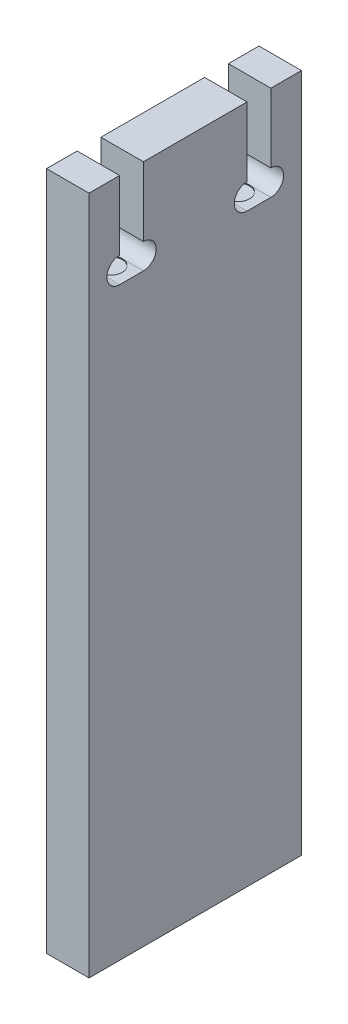
ISO-10303-21;
HEADER;
FILE_DESCRIPTION(('STEP AP214'),'2;1');
FILE_NAME('part.step','',(''),(''),'','','');
FILE_SCHEMA(('AUTOMOTIVE_DESIGN { 1 0 10303 214 1 1 1 1 }'));
ENDSEC;
DATA;
#1=APPLICATION_CONTEXT('core data for automotive mechanical design processes');
#2=APPLICATION_PROTOCOL_DEFINITION('international standard','automotive_design',2000,#1);
#3=PRODUCT_CONTEXT('',#1,'mechanical');
#4=PRODUCT('Part','Part','',(#3));
#5=PRODUCT_RELATED_PRODUCT_CATEGORY('part','',(#4));
#6=PRODUCT_DEFINITION_FORMATION('','',#4);
#7=PRODUCT_DEFINITION_CONTEXT('part definition',#1,'design');
#8=PRODUCT_DEFINITION('design','',#6,#7);
#9=PRODUCT_DEFINITION_SHAPE('','',#8);
#10=(LENGTH_UNIT() NAMED_UNIT(*) SI_UNIT(.MILLI.,.METRE.));
#11=(NAMED_UNIT(*) PLANE_ANGLE_UNIT() SI_UNIT($,.RADIAN.));
#12=(NAMED_UNIT(*) SI_UNIT($,.STERADIAN.) SOLID_ANGLE_UNIT());
#13=UNCERTAINTY_MEASURE_WITH_UNIT(LENGTH_MEASURE(1.E-05),#10,'distance_accuracy_value','');
#14=(GEOMETRIC_REPRESENTATION_CONTEXT(3) GLOBAL_UNCERTAINTY_ASSIGNED_CONTEXT((#13)) GLOBAL_UNIT_ASSIGNED_CONTEXT((#10,
#11,#12)) REPRESENTATION_CONTEXT('',''));
#15=CARTESIAN_POINT('',(0.,0.,0.));
#16=DIRECTION('',(0.,0.,1.));
#17=DIRECTION('',(1.,0.,0.));
#18=AXIS2_PLACEMENT_3D('',#15,#16,#17);
#19=CARTESIAN_POINT('',(2.5,68.8743999999999,-18.6000000000001));
#20=DIRECTION('',(0.,1.,0.));
#21=DIRECTION('',(0.,0.,1.));
#22=AXIS2_PLACEMENT_3D('',#19,#20,#21);
#23=PLANE('',#22);
#24=CARTESIAN_POINT('',(0.,68.8743999999999,-20.0000000000001));
#25=DIRECTION('',(0.,1.,0.));
#26=DIRECTION('',(0.,0.,1.));
#27=AXIS2_PLACEMENT_3D('',#24,#25,#26);
#28=CIRCLE('',#27,1.40000000000001);
#29=CARTESIAN_POINT('',(0.,68.8743999999999,-18.6000000000001));
#30=VERTEX_POINT('',#29);
#31=CARTESIAN_POINT('',(0.,68.8743999999999,-21.4000000000001));
#32=VERTEX_POINT('',#31);
#33=EDGE_CURVE('E50',#30,#32,#28,.T.);
#34=ORIENTED_EDGE('',*,*,#33,.F.);
#35=DIRECTION('',(-1.,0.,0.));
#36=VECTOR('',#35,1.);
#37=CARTESIAN_POINT('',(2.5,68.8743999999999,-18.6000000000001));
#38=LINE('',#37,#36);
#39=CARTESIAN_POINT('',(2.5,68.8743999999999,-18.6000000000001));
#40=VERTEX_POINT('',#39);
#41=EDGE_CURVE('E266',#40,#30,#38,.T.);
#42=ORIENTED_EDGE('',*,*,#41,.F.);
#43=DIRECTION('',(0.,0.,-1.));
#44=VECTOR('',#43,1.);
#45=CARTESIAN_POINT('',(2.5,68.8743999999999,-18.6000000000001));
#46=LINE('',#45,#44);
#47=CARTESIAN_POINT('',(2.5,68.8743999999999,-21.4000000000001));
#48=VERTEX_POINT('',#47);
#49=EDGE_CURVE('E311',#40,#48,#46,.T.);
#50=ORIENTED_EDGE('',*,*,#49,.T.);
#51=DIRECTION('',(-1.,0.,0.));
#52=VECTOR('',#51,1.);
#53=CARTESIAN_POINT('',(2.5,68.8743999999999,-21.4000000000001));
#54=LINE('',#53,#52);
#55=EDGE_CURVE('E262',#48,#32,#54,.T.);
#56=ORIENTED_EDGE('',*,*,#55,.T.);
#57=EDGE_LOOP('',(#34,#42,#50,#56));
#58=FACE_BOUND('',#57,.T.);
#59=ADVANCED_FACE('F34',(#58),#23,.T.);
#60=CARTESIAN_POINT('',(2.5,68.8743999999999,-6.39999999999985));
#61=DIRECTION('',(0.,-1.,0.));
#62=DIRECTION('',(0.,0.,-1.));
#63=AXIS2_PLACEMENT_3D('',#60,#61,#62);
#64=PLANE('',#63);
#65=DIRECTION('',(-1.,0.,0.));
#66=VECTOR('',#65,1.);
#67=CARTESIAN_POINT('',(2.5,68.8743999999999,-6.39999999999985));
#68=LINE('',#67,#66);
#69=CARTESIAN_POINT('',(2.5,68.8743999999999,-6.39999999999985));
#70=VERTEX_POINT('',#69);
#71=CARTESIAN_POINT('',(0.,68.8743999999999,-6.39999999999985));
#72=VERTEX_POINT('',#71);
#73=EDGE_CURVE('E171',#70,#72,#68,.T.);
#74=ORIENTED_EDGE('',*,*,#73,.T.);
#75=CARTESIAN_POINT('',(0.,68.8743999999999,-4.99999999999984));
#76=DIRECTION('',(0.,1.,0.));
#77=DIRECTION('',(0.,0.,1.));
#78=AXIS2_PLACEMENT_3D('',#75,#76,#77);
#79=CIRCLE('',#78,1.40000000000001);
#80=CARTESIAN_POINT('',(0.,68.8743999999999,-3.59999999999983));
#81=VERTEX_POINT('',#80);
#82=EDGE_CURVE('E57',#81,#72,#79,.T.);
#83=ORIENTED_EDGE('',*,*,#82,.F.);
#84=DIRECTION('',(-1.,0.,0.));
#85=VECTOR('',#84,1.);
#86=CARTESIAN_POINT('',(2.5,68.8743999999999,-3.59999999999983));
#87=LINE('',#86,#85);
#88=CARTESIAN_POINT('',(2.5,68.8743999999999,-3.59999999999983));
#89=VERTEX_POINT('',#88);
#90=EDGE_CURVE('E169',#89,#81,#87,.T.);
#91=ORIENTED_EDGE('',*,*,#90,.F.);
#92=DIRECTION('',(0.,0.,1.));
#93=VECTOR('',#92,1.);
#94=CARTESIAN_POINT('',(2.5,68.8743999999999,-6.39999999999985));
#95=LINE('',#94,#93);
#96=EDGE_CURVE('E293',#70,#89,#95,.T.);
#97=ORIENTED_EDGE('',*,*,#96,.F.);
#98=EDGE_LOOP('',(#74,#83,#91,#97));
#99=FACE_BOUND('',#98,.T.);
#100=ADVANCED_FACE('F166',(#99),#64,.F.);
#101=CARTESIAN_POINT('',(2.5,79.9999999999996,0.));
#102=DIRECTION('',(0.,1.,0.));
#103=DIRECTION('',(0.,0.,1.));
#104=AXIS2_PLACEMENT_3D('',#101,#102,#103);
#105=PLANE('',#104);
#106=DIRECTION('',(0.,0.,-1.));
#107=VECTOR('',#106,1.);
#108=CARTESIAN_POINT('',(-2.5,79.9999999999996,0.));
#109=LINE('',#108,#107);
#110=CARTESIAN_POINT('',(-2.5,79.9999999999996,0.));
#111=VERTEX_POINT('',#110);
#112=CARTESIAN_POINT('',(-2.5,79.9999999999996,-3.59999999999983));
#113=VERTEX_POINT('',#112);
#114=EDGE_CURVE('E206',#111,#113,#109,.T.);
#115=ORIENTED_EDGE('',*,*,#114,.F.);
#116=DIRECTION('',(-1.,0.,0.));
#117=VECTOR('',#116,1.);
#118=CARTESIAN_POINT('',(2.5,79.9999999999996,0.));
#119=LINE('',#118,#117);
#120=CARTESIAN_POINT('',(2.5,79.9999999999996,0.));
#121=VERTEX_POINT('',#120);
#122=EDGE_CURVE('E11',#121,#111,#119,.T.);
#123=ORIENTED_EDGE('',*,*,#122,.F.);
#124=DIRECTION('',(0.,0.,-1.));
#125=VECTOR('',#124,1.);
#126=CARTESIAN_POINT('',(2.5,79.9999999999996,0.));
#127=LINE('',#126,#125);
#128=CARTESIAN_POINT('',(2.5,79.9999999999996,-3.59999999999983));
#129=VERTEX_POINT('',#128);
#130=EDGE_CURVE('E250',#121,#129,#127,.T.);
#131=ORIENTED_EDGE('',*,*,#130,.T.);
#132=DIRECTION('',(-1.,0.,0.));
#133=VECTOR('',#132,1.);
#134=CARTESIAN_POINT('',(2.5,79.9999999999996,-3.59999999999983));
#135=LINE('',#134,#133);
#136=EDGE_CURVE('E38',#129,#113,#135,.T.);
#137=ORIENTED_EDGE('',*,*,#136,.T.);
#138=EDGE_LOOP('',(#115,#123,#131,#137));
#139=FACE_BOUND('',#138,.T.);
#140=ADVANCED_FACE('F36',(#139),#105,.T.);
#141=CARTESIAN_POINT('',(2.5,79.9999999999996,0.));
#142=DIRECTION('',(0.,0.,-1.));
#143=DIRECTION('',(-1.,0.,0.));
#144=AXIS2_PLACEMENT_3D('',#141,#142,#143);
#145=PLANE('',#144);
#146=DIRECTION('',(0.,-1.,0.));
#147=VECTOR('',#146,1.);
#148=CARTESIAN_POINT('',(-2.5,79.9999999999996,0.));
#149=LINE('',#148,#147);
#150=CARTESIAN_POINT('',(-2.5,0.,0.));
#151=VERTEX_POINT('',#150);
#152=EDGE_CURVE('E249',#111,#151,#149,.T.);
#153=ORIENTED_EDGE('',*,*,#152,.T.);
#154=DIRECTION('',(-1.,0.,0.));
#155=VECTOR('',#154,1.);
#156=CARTESIAN_POINT('',(2.5,0.,0.));
#157=LINE('',#156,#155);
#158=CARTESIAN_POINT('',(2.5,0.,0.));
#159=VERTEX_POINT('',#158);
#160=EDGE_CURVE('E43',#159,#151,#157,.T.);
#161=ORIENTED_EDGE('',*,*,#160,.F.);
#162=DIRECTION('',(0.,-1.,0.));
#163=VECTOR('',#162,1.);
#164=CARTESIAN_POINT('',(2.5,79.9999999999996,0.));
#165=LINE('',#164,#163);
#166=EDGE_CURVE('E192',#121,#159,#165,.T.);
#167=ORIENTED_EDGE('',*,*,#166,.F.);
#168=ORIENTED_EDGE('',*,*,#122,.T.);
#169=EDGE_LOOP('',(#153,#161,#167,#168));
#170=FACE_BOUND('',#169,.T.);
#171=ADVANCED_FACE('F366',(#170),#145,.F.);
#172=CARTESIAN_POINT('',(2.5,0.,0.));
#173=DIRECTION('',(0.,1.,0.));
#174=DIRECTION('',(0.,0.,1.));
#175=AXIS2_PLACEMENT_3D('',#172,#173,#174);
#176=PLANE('',#175);
#177=DIRECTION('',(0.,0.,-1.));
#178=VECTOR('',#177,1.);
#179=CARTESIAN_POINT('',(-2.5,0.,0.));
#180=LINE('',#179,#178);
#181=CARTESIAN_POINT('',(-2.5,0.,-24.9999999999999));
#182=VERTEX_POINT('',#181);
#183=EDGE_CURVE('E246',#151,#182,#180,.T.);
#184=ORIENTED_EDGE('',*,*,#183,.T.);
#185=DIRECTION('',(-1.,0.,0.));
#186=VECTOR('',#185,1.);
#187=CARTESIAN_POINT('',(2.5,0.,-24.9999999999999));
#188=LINE('',#187,#186);
#189=CARTESIAN_POINT('',(2.5,0.,-24.9999999999999));
#190=VERTEX_POINT('',#189);
#191=EDGE_CURVE('E254',#190,#182,#188,.T.);
#192=ORIENTED_EDGE('',*,*,#191,.F.);
#193=DIRECTION('',(0.,0.,-1.));
#194=VECTOR('',#193,1.);
#195=CARTESIAN_POINT('',(2.5,0.,0.));
#196=LINE('',#195,#194);
#197=EDGE_CURVE('E196',#159,#190,#196,.T.);
#198=ORIENTED_EDGE('',*,*,#197,.F.);
#199=ORIENTED_EDGE('',*,*,#160,.T.);
#200=EDGE_LOOP('',(#184,#192,#198,#199));
#201=FACE_BOUND('',#200,.T.);
#202=ADVANCED_FACE('F364',(#201),#176,.F.);
#203=CARTESIAN_POINT('',(2.5,79.9999999999996,-24.9999999999999));
#204=DIRECTION('',(0.,0.,-1.));
#205=DIRECTION('',(-1.,0.,0.));
#206=AXIS2_PLACEMENT_3D('',#203,#204,#205);
#207=PLANE('',#206);
#208=DIRECTION('',(0.,-1.,0.));
#209=VECTOR('',#208,1.);
#210=CARTESIAN_POINT('',(-2.5,79.9999999999996,-24.9999999999999));
#211=LINE('',#210,#209);
#212=CARTESIAN_POINT('',(-2.5,79.9999999999996,-24.9999999999999));
#213=VERTEX_POINT('',#212);
#214=EDGE_CURVE('E243',#213,#182,#211,.T.);
#215=ORIENTED_EDGE('',*,*,#214,.F.);
#216=DIRECTION('',(-1.,0.,0.));
#217=VECTOR('',#216,1.);
#218=CARTESIAN_POINT('',(2.5,79.9999999999996,-24.9999999999999));
#219=LINE('',#218,#217);
#220=CARTESIAN_POINT('',(2.5,79.9999999999996,-24.9999999999999));
#221=VERTEX_POINT('',#220);
#222=EDGE_CURVE('E256',#221,#213,#219,.T.);
#223=ORIENTED_EDGE('',*,*,#222,.F.);
#224=DIRECTION('',(0.,-1.,0.));
#225=VECTOR('',#224,1.);
#226=CARTESIAN_POINT('',(2.5,79.9999999999996,-24.9999999999999));
#227=LINE('',#226,#225);
#228=EDGE_CURVE('E202',#221,#190,#227,.T.);
#229=ORIENTED_EDGE('',*,*,#228,.T.);
#230=ORIENTED_EDGE('',*,*,#191,.T.);
#231=EDGE_LOOP('',(#215,#223,#229,#230));
#232=FACE_BOUND('',#231,.T.);
#233=ADVANCED_FACE('F325',(#232),#207,.T.);
#234=CARTESIAN_POINT('',(2.5,79.9999999999996,-21.4000000000001));
#235=DIRECTION('',(0.,1.,0.));
#236=DIRECTION('',(0.,0.,1.));
#237=AXIS2_PLACEMENT_3D('',#234,#235,#236);
#238=PLANE('',#237);
#239=DIRECTION('',(0.,0.,-1.));
#240=VECTOR('',#239,1.);
#241=CARTESIAN_POINT('',(-2.5,79.9999999999996,-21.4000000000001));
#242=LINE('',#241,#240);
#243=CARTESIAN_POINT('',(-2.5,79.9999999999996,-21.4000000000001));
#244=VERTEX_POINT('',#243);
#245=EDGE_CURVE('E240',#244,#213,#242,.T.);
#246=ORIENTED_EDGE('',*,*,#245,.F.);
#247=DIRECTION('',(-1.,0.,0.));
#248=VECTOR('',#247,1.);
#249=CARTESIAN_POINT('',(2.5,79.9999999999996,-21.4000000000001));
#250=LINE('',#249,#248);
#251=CARTESIAN_POINT('',(2.5,79.9999999999996,-21.4000000000001));
#252=VERTEX_POINT('',#251);
#253=EDGE_CURVE('E258',#252,#244,#250,.T.);
#254=ORIENTED_EDGE('',*,*,#253,.F.);
#255=DIRECTION('',(0.,0.,-1.));
#256=VECTOR('',#255,1.);
#257=CARTESIAN_POINT('',(2.5,79.9999999999996,-21.4000000000001));
#258=LINE('',#257,#256);
#259=EDGE_CURVE('E319',#252,#221,#258,.T.);
#260=ORIENTED_EDGE('',*,*,#259,.T.);
#261=ORIENTED_EDGE('',*,*,#222,.T.);
#262=EDGE_LOOP('',(#246,#254,#260,#261));
#263=FACE_BOUND('',#262,.T.);
#264=ADVANCED_FACE('F331',(#263),#238,.T.);
#265=CARTESIAN_POINT('',(2.5,79.9999999999996,-21.4000000000001));
#266=DIRECTION('',(0.,0.,-1.));
#267=DIRECTION('',(-1.,0.,0.));
#268=AXIS2_PLACEMENT_3D('',#265,#266,#267);
#269=PLANE('',#268);
#270=DIRECTION('',(0.,-1.,0.));
#271=VECTOR('',#270,1.);
#272=CARTESIAN_POINT('',(-2.5,79.9999999999996,-21.4000000000001));
#273=LINE('',#272,#271);
#274=CARTESIAN_POINT('',(-2.5,71.8744,-21.4000000000001));
#275=VERTEX_POINT('',#274);
#276=EDGE_CURVE('E237',#244,#275,#273,.T.);
#277=ORIENTED_EDGE('',*,*,#276,.T.);
#278=DIRECTION('',(-1.,0.,0.));
#279=VECTOR('',#278,1.);
#280=CARTESIAN_POINT('',(2.5,71.8744,-21.4000000000001));
#281=LINE('',#280,#279);
#282=CARTESIAN_POINT('',(2.5,71.8744,-21.4000000000001));
#283=VERTEX_POINT('',#282);
#284=EDGE_CURVE('E260',#283,#275,#281,.T.);
#285=ORIENTED_EDGE('',*,*,#284,.F.);
#286=DIRECTION('',(0.,-1.,0.));
#287=VECTOR('',#286,1.);
#288=CARTESIAN_POINT('',(2.5,79.9999999999996,-21.4000000000001));
#289=LINE('',#288,#287);
#290=EDGE_CURVE('E317',#252,#283,#289,.T.);
#291=ORIENTED_EDGE('',*,*,#290,.F.);
#292=ORIENTED_EDGE('',*,*,#253,.T.);
#293=EDGE_LOOP('',(#277,#285,#291,#292));
#294=FACE_BOUND('',#293,.T.);
#295=ADVANCED_FACE('F336',(#294),#269,.F.);
#296=CARTESIAN_POINT('',(2.5,70.3744,-21.4000000000001));
#297=DIRECTION('',(-1.,0.,0.));
#298=DIRECTION('',(0.,0.,1.));
#299=AXIS2_PLACEMENT_3D('',#296,#297,#298);
#300=CYLINDRICAL_SURFACE('',#299,1.50000000000006);
#301=CARTESIAN_POINT('',(-2.5,70.3744,-21.4000000000001));
#302=DIRECTION('',(1.,0.,0.));
#303=DIRECTION('',(0.,0.,-1.));
#304=AXIS2_PLACEMENT_3D('',#301,#302,#303);
#305=CIRCLE('',#304,1.50000000000006);
#306=CARTESIAN_POINT('',(-2.5,68.8743999999999,-21.4000000000001));
#307=VERTEX_POINT('',#306);
#308=EDGE_CURVE('E234',#307,#275,#305,.T.);
#309=ORIENTED_EDGE('',*,*,#308,.F.);
#310=EDGE_CURVE('E265',#32,#307,#54,.T.);
#311=ORIENTED_EDGE('',*,*,#310,.F.);
#312=ORIENTED_EDGE('',*,*,#55,.F.);
#313=CARTESIAN_POINT('',(2.5,70.3744,-21.4000000000001));
#314=DIRECTION('',(1.,0.,0.));
#315=DIRECTION('',(0.,0.,-1.));
#316=AXIS2_PLACEMENT_3D('',#313,#314,#315);
#317=CIRCLE('',#316,1.50000000000006);
#318=EDGE_CURVE('E314',#48,#283,#317,.T.);
#319=ORIENTED_EDGE('',*,*,#318,.T.);
#320=ORIENTED_EDGE('',*,*,#284,.T.);
#321=EDGE_LOOP('',(#309,#311,#312,#319,#320));
#322=FACE_BOUND('',#321,.T.);
#323=ADVANCED_FACE('F360',(#322),#300,.F.);
#324=EDGE_CURVE('E359',#32,#30,#28,.T.);
#325=ORIENTED_EDGE('',*,*,#324,.F.);
#326=ORIENTED_EDGE('',*,*,#310,.T.);
#327=DIRECTION('',(0.,0.,-1.));
#328=VECTOR('',#327,1.);
#329=CARTESIAN_POINT('',(-2.5,68.8743999999999,-18.6000000000001));
#330=LINE('',#329,#328);
#331=CARTESIAN_POINT('',(-2.5,68.8743999999999,-18.6000000000001));
#332=VERTEX_POINT('',#331);
#333=EDGE_CURVE('E231',#332,#307,#330,.T.);
#334=ORIENTED_EDGE('',*,*,#333,.F.);
#335=EDGE_CURVE('E269',#30,#332,#38,.T.);
#336=ORIENTED_EDGE('',*,*,#335,.F.);
#337=EDGE_LOOP('',(#325,#326,#334,#336));
#338=FACE_BOUND('',#337,.T.);
#339=ADVANCED_FACE('F357',(#338),#23,.T.);
#340=CARTESIAN_POINT('',(2.5,70.3744,-18.6000000000001));
#341=DIRECTION('',(-1.,0.,0.));
#342=DIRECTION('',(0.,0.,1.));
#343=AXIS2_PLACEMENT_3D('',#340,#341,#342);
#344=CYLINDRICAL_SURFACE('',#343,1.50000000000006);
#345=CARTESIAN_POINT('',(-2.5,70.3744,-18.6000000000001));
#346=DIRECTION('',(1.,0.,0.));
#347=DIRECTION('',(0.,0.,-1.));
#348=AXIS2_PLACEMENT_3D('',#345,#346,#347);
#349=CIRCLE('',#348,1.50000000000006);
#350=CARTESIAN_POINT('',(-2.5,71.8744,-18.6000000000001));
#351=VERTEX_POINT('',#350);
#352=EDGE_CURVE('E228',#351,#332,#349,.T.);
#353=ORIENTED_EDGE('',*,*,#352,.F.);
#354=DIRECTION('',(-1.,0.,0.));
#355=VECTOR('',#354,1.);
#356=CARTESIAN_POINT('',(2.5,71.8744,-18.6000000000001));
#357=LINE('',#356,#355);
#358=CARTESIAN_POINT('',(2.5,71.8744,-18.6000000000001));
#359=VERTEX_POINT('',#358);
#360=EDGE_CURVE('E270',#359,#351,#357,.T.);
#361=ORIENTED_EDGE('',*,*,#360,.F.);
#362=CARTESIAN_POINT('',(2.5,70.3744,-18.6000000000001));
#363=DIRECTION('',(1.,0.,0.));
#364=DIRECTION('',(0.,0.,-1.));
#365=AXIS2_PLACEMENT_3D('',#362,#363,#364);
#366=CIRCLE('',#365,1.50000000000006);
#367=EDGE_CURVE('E308',#359,#40,#366,.T.);
#368=ORIENTED_EDGE('',*,*,#367,.T.);
#369=ORIENTED_EDGE('',*,*,#41,.T.);
#370=ORIENTED_EDGE('',*,*,#335,.T.);
#371=EDGE_LOOP('',(#353,#361,#368,#369,#370));
#372=FACE_BOUND('',#371,.T.);
#373=ADVANCED_FACE('F345',(#372),#344,.F.);
#374=CARTESIAN_POINT('',(2.5,71.8744,-18.6000000000001));
#375=DIRECTION('',(0.,0.,1.));
#376=DIRECTION('',(1.,0.,0.));
#377=AXIS2_PLACEMENT_3D('',#374,#375,#376);
#378=PLANE('',#377);
#379=DIRECTION('',(0.,1.,0.));
#380=VECTOR('',#379,1.);
#381=CARTESIAN_POINT('',(-2.5,71.8744,-18.6000000000001));
#382=LINE('',#381,#380);
#383=CARTESIAN_POINT('',(-2.5,79.9999999999996,-18.6000000000001));
#384=VERTEX_POINT('',#383);
#385=EDGE_CURVE('E225',#351,#384,#382,.T.);
#386=ORIENTED_EDGE('',*,*,#385,.T.);
#387=DIRECTION('',(-1.,0.,0.));
#388=VECTOR('',#387,1.);
#389=CARTESIAN_POINT('',(2.5,79.9999999999996,-18.6000000000001));
#390=LINE('',#389,#388);
#391=CARTESIAN_POINT('',(2.5,79.9999999999996,-18.6000000000001));
#392=VERTEX_POINT('',#391);
#393=EDGE_CURVE('E272',#392,#384,#390,.T.);
#394=ORIENTED_EDGE('',*,*,#393,.F.);
#395=DIRECTION('',(0.,1.,0.));
#396=VECTOR('',#395,1.);
#397=CARTESIAN_POINT('',(2.5,71.8744,-18.6000000000001));
#398=LINE('',#397,#396);
#399=EDGE_CURVE('E306',#359,#392,#398,.T.);
#400=ORIENTED_EDGE('',*,*,#399,.F.);
#401=ORIENTED_EDGE('',*,*,#360,.T.);
#402=EDGE_LOOP('',(#386,#394,#400,#401));
#403=FACE_BOUND('',#402,.T.);
#404=ADVANCED_FACE('F351',(#403),#378,.F.);
#405=CARTESIAN_POINT('',(2.5,79.9999999999996,-6.39999999999985));
#406=DIRECTION('',(0.,1.,0.));
#407=DIRECTION('',(0.,0.,1.));
#408=AXIS2_PLACEMENT_3D('',#405,#406,#407);
#409=PLANE('',#408);
#410=DIRECTION('',(0.,0.,-1.));
#411=VECTOR('',#410,1.);
#412=CARTESIAN_POINT('',(-2.5,79.9999999999996,-6.39999999999985));
#413=LINE('',#412,#411);
#414=CARTESIAN_POINT('',(-2.5,79.9999999999996,-6.39999999999985));
#415=VERTEX_POINT('',#414);
#416=EDGE_CURVE('E222',#415,#384,#413,.T.);
#417=ORIENTED_EDGE('',*,*,#416,.F.);
#418=DIRECTION('',(-1.,0.,0.));
#419=VECTOR('',#418,1.);
#420=CARTESIAN_POINT('',(2.5,79.9999999999996,-6.39999999999985));
#421=LINE('',#420,#419);
#422=CARTESIAN_POINT('',(2.5,79.9999999999996,-6.39999999999985));
#423=VERTEX_POINT('',#422);
#424=EDGE_CURVE('E274',#423,#415,#421,.T.);
#425=ORIENTED_EDGE('',*,*,#424,.F.);
#426=DIRECTION('',(0.,0.,-1.));
#427=VECTOR('',#426,1.);
#428=CARTESIAN_POINT('',(2.5,79.9999999999996,-6.39999999999985));
#429=LINE('',#428,#427);
#430=EDGE_CURVE('E303',#423,#392,#429,.T.);
#431=ORIENTED_EDGE('',*,*,#430,.T.);
#432=ORIENTED_EDGE('',*,*,#393,.T.);
#433=EDGE_LOOP('',(#417,#425,#431,#432));
#434=FACE_BOUND('',#433,.T.);
#435=ADVANCED_FACE('F354',(#434),#409,.T.);
#436=CARTESIAN_POINT('',(2.5,71.8744,-6.39999999999985));
#437=DIRECTION('',(0.,0.,1.));
#438=DIRECTION('',(1.,0.,0.));
#439=AXIS2_PLACEMENT_3D('',#436,#437,#438);
#440=PLANE('',#439);
#441=DIRECTION('',(0.,1.,0.));
#442=VECTOR('',#441,1.);
#443=CARTESIAN_POINT('',(-2.5,71.8744,-6.39999999999985));
#444=LINE('',#443,#442);
#445=CARTESIAN_POINT('',(-2.5,71.8744,-6.39999999999985));
#446=VERTEX_POINT('',#445);
#447=EDGE_CURVE('E219',#446,#415,#444,.T.);
#448=ORIENTED_EDGE('',*,*,#447,.F.);
#449=DIRECTION('',(-1.,0.,0.));
#450=VECTOR('',#449,1.);
#451=CARTESIAN_POINT('',(2.5,71.8744,-6.39999999999985));
#452=LINE('',#451,#450);
#453=CARTESIAN_POINT('',(2.5,71.8744,-6.39999999999985));
#454=VERTEX_POINT('',#453);
#455=EDGE_CURVE('E275',#454,#446,#452,.T.);
#456=ORIENTED_EDGE('',*,*,#455,.F.);
#457=DIRECTION('',(0.,1.,0.));
#458=VECTOR('',#457,1.);
#459=CARTESIAN_POINT('',(2.5,71.8744,-6.39999999999985));
#460=LINE('',#459,#458);
#461=EDGE_CURVE('E301',#454,#423,#460,.T.);
#462=ORIENTED_EDGE('',*,*,#461,.T.);
#463=ORIENTED_EDGE('',*,*,#424,.T.);
#464=EDGE_LOOP('',(#448,#456,#462,#463));
#465=FACE_BOUND('',#464,.T.);
#466=ADVANCED_FACE('F286',(#465),#440,.T.);
#467=CARTESIAN_POINT('',(2.5,70.3744,-6.39999999999985));
#468=DIRECTION('',(-1.,0.,0.));
#469=DIRECTION('',(0.,0.,1.));
#470=AXIS2_PLACEMENT_3D('',#467,#468,#469);
#471=CYLINDRICAL_SURFACE('',#470,1.50000000000006);
#472=CARTESIAN_POINT('',(-2.5,70.3744,-6.39999999999985));
#473=DIRECTION('',(1.,0.,0.));
#474=DIRECTION('',(0.,0.,-1.));
#475=AXIS2_PLACEMENT_3D('',#472,#473,#474);
#476=CIRCLE('',#475,1.50000000000006);
#477=CARTESIAN_POINT('',(-2.5,68.8743999999999,-6.39999999999985));
#478=VERTEX_POINT('',#477);
#479=EDGE_CURVE('E216',#478,#446,#476,.T.);
#480=ORIENTED_EDGE('',*,*,#479,.F.);
#481=EDGE_CURVE('E186',#72,#478,#68,.T.);
#482=ORIENTED_EDGE('',*,*,#481,.F.);
#483=ORIENTED_EDGE('',*,*,#73,.F.);
#484=CARTESIAN_POINT('',(2.5,70.3744,-6.39999999999985));
#485=DIRECTION('',(1.,0.,0.));
#486=DIRECTION('',(0.,0.,-1.));
#487=AXIS2_PLACEMENT_3D('',#484,#485,#486);
#488=CIRCLE('',#487,1.50000000000006);
#489=EDGE_CURVE('E282',#70,#454,#488,.T.);
#490=ORIENTED_EDGE('',*,*,#489,.T.);
#491=ORIENTED_EDGE('',*,*,#455,.T.);
#492=EDGE_LOOP('',(#480,#482,#483,#490,#491));
#493=FACE_BOUND('',#492,.T.);
#494=ADVANCED_FACE('F280',(#493),#471,.F.);
#495=CARTESIAN_POINT('',(-2.5,68.8743999999999,-3.59999999999983));
#496=VERTEX_POINT('',#495);
#497=EDGE_CURVE('E174',#81,#496,#87,.T.);
#498=ORIENTED_EDGE('',*,*,#497,.F.);
#499=EDGE_CURVE('E157',#72,#81,#79,.T.);
#500=ORIENTED_EDGE('',*,*,#499,.F.);
#501=ORIENTED_EDGE('',*,*,#481,.T.);
#502=DIRECTION('',(0.,0.,1.));
#503=VECTOR('',#502,1.);
#504=CARTESIAN_POINT('',(-2.5,68.8743999999999,-6.39999999999985));
#505=LINE('',#504,#503);
#506=EDGE_CURVE('E177',#478,#496,#505,.T.);
#507=ORIENTED_EDGE('',*,*,#506,.T.);
#508=EDGE_LOOP('',(#498,#500,#501,#507));
#509=FACE_BOUND('',#508,.T.);
#510=ADVANCED_FACE('F175',(#509),#64,.F.);
#511=CARTESIAN_POINT('',(2.5,70.3744,-3.59999999999983));
#512=DIRECTION('',(-1.,0.,0.));
#513=DIRECTION('',(0.,0.,1.));
#514=AXIS2_PLACEMENT_3D('',#511,#512,#513);
#515=CYLINDRICAL_SURFACE('',#514,1.50000000000006);
#516=CARTESIAN_POINT('',(-2.5,70.3744,-3.59999999999983));
#517=DIRECTION('',(1.,0.,0.));
#518=DIRECTION('',(0.,0.,-1.));
#519=AXIS2_PLACEMENT_3D('',#516,#517,#518);
#520=CIRCLE('',#519,1.50000000000006);
#521=CARTESIAN_POINT('',(-2.5,71.8744,-3.59999999999983));
#522=VERTEX_POINT('',#521);
#523=EDGE_CURVE('E213',#522,#496,#520,.T.);
#524=ORIENTED_EDGE('',*,*,#523,.F.);
#525=DIRECTION('',(-1.,0.,0.));
#526=VECTOR('',#525,1.);
#527=CARTESIAN_POINT('',(2.5,71.8744,-3.59999999999983));
#528=LINE('',#527,#526);
#529=CARTESIAN_POINT('',(2.5,71.8744,-3.59999999999983));
#530=VERTEX_POINT('',#529);
#531=EDGE_CURVE('E181',#530,#522,#528,.T.);
#532=ORIENTED_EDGE('',*,*,#531,.F.);
#533=CARTESIAN_POINT('',(2.5,70.3744,-3.59999999999983));
#534=DIRECTION('',(1.,0.,0.));
#535=DIRECTION('',(0.,0.,-1.));
#536=AXIS2_PLACEMENT_3D('',#533,#534,#535);
#537=CIRCLE('',#536,1.50000000000006);
#538=EDGE_CURVE('E185',#530,#89,#537,.T.);
#539=ORIENTED_EDGE('',*,*,#538,.T.);
#540=ORIENTED_EDGE('',*,*,#90,.T.);
#541=ORIENTED_EDGE('',*,*,#497,.T.);
#542=EDGE_LOOP('',(#524,#532,#539,#540,#541));
#543=FACE_BOUND('',#542,.T.);
#544=ADVANCED_FACE('F183',(#543),#515,.F.);
#545=CARTESIAN_POINT('',(2.5,79.9999999999996,-3.59999999999983));
#546=DIRECTION('',(0.,0.,-1.));
#547=DIRECTION('',(-1.,0.,0.));
#548=AXIS2_PLACEMENT_3D('',#545,#546,#547);
#549=PLANE('',#548);
#550=DIRECTION('',(0.,-1.,0.));
#551=VECTOR('',#550,1.);
#552=CARTESIAN_POINT('',(-2.5,79.9999999999996,-3.59999999999983));
#553=LINE('',#552,#551);
#554=EDGE_CURVE('E209',#113,#522,#553,.T.);
#555=ORIENTED_EDGE('',*,*,#554,.F.);
#556=ORIENTED_EDGE('',*,*,#136,.F.);
#557=DIRECTION('',(0.,-1.,0.));
#558=VECTOR('',#557,1.);
#559=CARTESIAN_POINT('',(2.5,79.9999999999996,-3.59999999999983));
#560=LINE('',#559,#558);
#561=EDGE_CURVE('E292',#129,#530,#560,.T.);
#562=ORIENTED_EDGE('',*,*,#561,.T.);
#563=ORIENTED_EDGE('',*,*,#531,.T.);
#564=EDGE_LOOP('',(#555,#556,#562,#563));
#565=FACE_BOUND('',#564,.T.);
#566=ADVANCED_FACE('F295',(#565),#549,.T.);
#567=CARTESIAN_POINT('',(2.5,70.3744,-3.59999999999983));
#568=DIRECTION('',(1.,0.,0.));
#569=DIRECTION('',(0.,0.,-1.));
#570=AXIS2_PLACEMENT_3D('',#567,#568,#569);
#571=PLANE('',#570);
#572=ORIENTED_EDGE('',*,*,#130,.F.);
#573=ORIENTED_EDGE('',*,*,#166,.T.);
#574=ORIENTED_EDGE('',*,*,#197,.T.);
#575=ORIENTED_EDGE('',*,*,#228,.F.);
#576=ORIENTED_EDGE('',*,*,#259,.F.);
#577=ORIENTED_EDGE('',*,*,#290,.T.);
#578=ORIENTED_EDGE('',*,*,#318,.F.);
#579=ORIENTED_EDGE('',*,*,#49,.F.);
#580=ORIENTED_EDGE('',*,*,#367,.F.);
#581=ORIENTED_EDGE('',*,*,#399,.T.);
#582=ORIENTED_EDGE('',*,*,#430,.F.);
#583=ORIENTED_EDGE('',*,*,#461,.F.);
#584=ORIENTED_EDGE('',*,*,#489,.F.);
#585=ORIENTED_EDGE('',*,*,#96,.T.);
#586=ORIENTED_EDGE('',*,*,#538,.F.);
#587=ORIENTED_EDGE('',*,*,#561,.F.);
#588=EDGE_LOOP('',(#572,#573,#574,#575,#576,#577,#578,#579,#580,#581,#582,#583,#584,#585,#586,#587));
#589=FACE_BOUND('',#588,.T.);
#590=ADVANCED_FACE('F291',(#589),#571,.T.);
#591=CARTESIAN_POINT('',(-2.5,70.3744,-3.59999999999983));
#592=DIRECTION('',(1.,0.,0.));
#593=DIRECTION('',(0.,0.,-1.));
#594=AXIS2_PLACEMENT_3D('',#591,#592,#593);
#595=PLANE('',#594);
#596=ORIENTED_EDGE('',*,*,#114,.T.);
#597=ORIENTED_EDGE('',*,*,#554,.T.);
#598=ORIENTED_EDGE('',*,*,#523,.T.);
#599=ORIENTED_EDGE('',*,*,#506,.F.);
#600=ORIENTED_EDGE('',*,*,#479,.T.);
#601=ORIENTED_EDGE('',*,*,#447,.T.);
#602=ORIENTED_EDGE('',*,*,#416,.T.);
#603=ORIENTED_EDGE('',*,*,#385,.F.);
#604=ORIENTED_EDGE('',*,*,#352,.T.);
#605=ORIENTED_EDGE('',*,*,#333,.T.);
#606=ORIENTED_EDGE('',*,*,#308,.T.);
#607=ORIENTED_EDGE('',*,*,#276,.F.);
#608=ORIENTED_EDGE('',*,*,#245,.T.);
#609=ORIENTED_EDGE('',*,*,#214,.T.);
#610=ORIENTED_EDGE('',*,*,#183,.F.);
#611=ORIENTED_EDGE('',*,*,#152,.F.);
#612=EDGE_LOOP('',(#596,#597,#598,#599,#600,#601,#602,#603,#604,#605,#606,#607,#608,#609,#610,#611));
#613=FACE_BOUND('',#612,.T.);
#614=ADVANCED_FACE('F289',(#613),#595,.F.);
#615=CARTESIAN_POINT('',(0.,68.7743999999999,-4.99999999999984));
#616=DIRECTION('',(0.,1.,0.));
#617=DIRECTION('',(0.,0.,1.));
#618=AXIS2_PLACEMENT_3D('',#615,#616,#617);
#619=CYLINDRICAL_SURFACE('',#618,1.40000000000001);
#620=CARTESIAN_POINT('',(0.,68.7743999999999,-4.99999999999984));
#621=DIRECTION('',(0.,1.,0.));
#622=DIRECTION('',(0.,0.,1.));
#623=AXIS2_PLACEMENT_3D('',#620,#621,#622);
#624=CIRCLE('',#623,1.40000000000001);
#625=CARTESIAN_POINT('',(0.,68.7743999999999,-3.59999999999983));
#626=VERTEX_POINT('',#625);
#627=EDGE_CURVE('E172',#626,#626,#624,.T.);
#628=ORIENTED_EDGE('',*,*,#627,.F.);
#629=EDGE_LOOP('',(#628));
#630=FACE_BOUND('',#629,.T.);
#631=ORIENTED_EDGE('',*,*,#82,.T.);
#632=ORIENTED_EDGE('',*,*,#499,.T.);
#633=EDGE_LOOP('',(#631,#632));
#634=FACE_BOUND('',#633,.T.);
#635=ADVANCED_FACE('F158',(#630,#634),#619,.F.);
#636=CARTESIAN_POINT('',(0.,68.7743999999999,-4.99999999999984));
#637=DIRECTION('',(0.,1.,0.));
#638=DIRECTION('',(0.,0.,1.));
#639=AXIS2_PLACEMENT_3D('',#636,#637,#638);
#640=PLANE('',#639);
#641=ORIENTED_EDGE('',*,*,#627,.T.);
#642=EDGE_LOOP('',(#641));
#643=FACE_BOUND('',#642,.T.);
#644=ADVANCED_FACE('F402',(#643),#640,.T.);
#645=CARTESIAN_POINT('',(0.,68.7743999999999,-20.0000000000001));
#646=DIRECTION('',(0.,1.,0.));
#647=DIRECTION('',(0.,0.,1.));
#648=AXIS2_PLACEMENT_3D('',#645,#646,#647);
#649=CYLINDRICAL_SURFACE('',#648,1.40000000000001);
#650=CARTESIAN_POINT('',(0.,68.7743999999999,-20.0000000000001));
#651=DIRECTION('',(0.,1.,0.));
#652=DIRECTION('',(0.,0.,1.));
#653=AXIS2_PLACEMENT_3D('',#650,#651,#652);
#654=CIRCLE('',#653,1.40000000000001);
#655=CARTESIAN_POINT('',(0.,68.7743999999999,-18.6000000000001));
#656=VERTEX_POINT('',#655);
#657=EDGE_CURVE('E210',#656,#656,#654,.T.);
#658=ORIENTED_EDGE('',*,*,#657,.F.);
#659=EDGE_LOOP('',(#658));
#660=FACE_BOUND('',#659,.T.);
#661=ORIENTED_EDGE('',*,*,#33,.T.);
#662=ORIENTED_EDGE('',*,*,#324,.T.);
#663=EDGE_LOOP('',(#661,#662));
#664=FACE_BOUND('',#663,.T.);
#665=ADVANCED_FACE('F406',(#660,#664),#649,.F.);
#666=CARTESIAN_POINT('',(0.,68.7743999999999,-20.0000000000001));
#667=DIRECTION('',(0.,1.,0.));
#668=DIRECTION('',(0.,0.,1.));
#669=AXIS2_PLACEMENT_3D('',#666,#667,#668);
#670=PLANE('',#669);
#671=ORIENTED_EDGE('',*,*,#657,.T.);
#672=EDGE_LOOP('',(#671));
#673=FACE_BOUND('',#672,.T.);
#674=ADVANCED_FACE('F410',(#673),#670,.T.);
#675=CLOSED_SHELL('',(#59,#100,#140,#171,#202,#233,#264,#295,#323,#339,#373,#404,#435,#466,#494,
#510,#544,#566,#590,#614,#635,#644,#665,#674));
#676=MANIFOLD_SOLID_BREP('B2',#675);
#677=ADVANCED_BREP_SHAPE_REPRESENTATION('',(#18,#676),#14);
#678=SHAPE_DEFINITION_REPRESENTATION(#9,#677);
ENDSEC;
END-ISO-10303-21;
